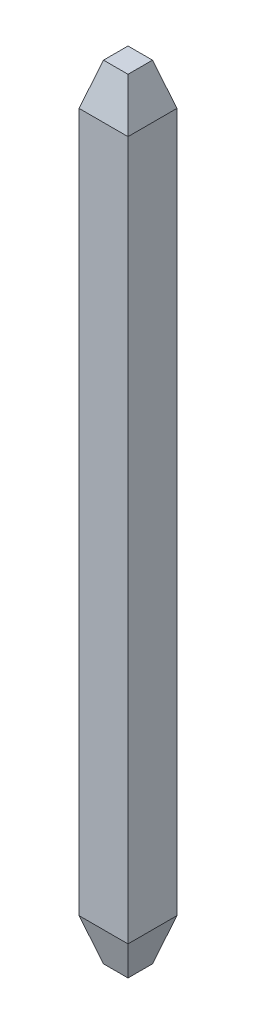
ISO-10303-21;
HEADER;
FILE_DESCRIPTION(('STEP AP214'),'2;1');
FILE_NAME('part.step','',(''),(''),'','','');
FILE_SCHEMA(('AUTOMOTIVE_DESIGN { 1 0 10303 214 1 1 1 1 }'));
ENDSEC;
DATA;
#1=APPLICATION_CONTEXT('core data for automotive mechanical design processes');
#2=APPLICATION_PROTOCOL_DEFINITION('international standard','automotive_design',2000,#1);
#3=PRODUCT_CONTEXT('',#1,'mechanical');
#4=PRODUCT('Part','Part','',(#3));
#5=PRODUCT_RELATED_PRODUCT_CATEGORY('part','',(#4));
#6=PRODUCT_DEFINITION_FORMATION('','',#4);
#7=PRODUCT_DEFINITION_CONTEXT('part definition',#1,'design');
#8=PRODUCT_DEFINITION('design','',#6,#7);
#9=PRODUCT_DEFINITION_SHAPE('','',#8);
#10=(LENGTH_UNIT() NAMED_UNIT(*) SI_UNIT(.MILLI.,.METRE.));
#11=(NAMED_UNIT(*) PLANE_ANGLE_UNIT() SI_UNIT($,.RADIAN.));
#12=(NAMED_UNIT(*) SI_UNIT($,.STERADIAN.) SOLID_ANGLE_UNIT());
#13=UNCERTAINTY_MEASURE_WITH_UNIT(LENGTH_MEASURE(1.E-05),#10,'distance_accuracy_value','');
#14=(GEOMETRIC_REPRESENTATION_CONTEXT(3) GLOBAL_UNCERTAINTY_ASSIGNED_CONTEXT((#13)) GLOBAL_UNIT_ASSIGNED_CONTEXT((#10,
#11,#12)) REPRESENTATION_CONTEXT('',''));
#15=CARTESIAN_POINT('',(0.,0.,0.));
#16=DIRECTION('',(0.,0.,1.));
#17=DIRECTION('',(1.,0.,0.));
#18=AXIS2_PLACEMENT_3D('',#15,#16,#17);
#19=CARTESIAN_POINT('',(-1.43099999998702,-5.53543505344793,-19.1999999999763));
#20=DIRECTION('',(0.,0.,1.));
#21=DIRECTION('',(1.,0.,0.));
#22=AXIS2_PLACEMENT_3D('',#19,#20,#21);
#23=PLANE('',#22);
#24=DIRECTION('',(0.,1.,0.));
#25=VECTOR('',#24,1.);
#26=CARTESIAN_POINT('',(-1.42999999998704,-10.1039999999832,-19.1999999999763));
#27=LINE('',#26,#25);
#28=CARTESIAN_POINT('',(-1.42999999998704,-10.1039999999832,-19.1999999999763));
#29=VERTEX_POINT('',#28);
#30=CARTESIAN_POINT('',(-1.42999999998704,-0.965870106912663,-19.1999999999763));
#31=VERTEX_POINT('',#30);
#32=EDGE_CURVE('E186',#29,#31,#27,.T.);
#33=ORIENTED_EDGE('',*,*,#32,.F.);
#34=DIRECTION('',(-1.,0.,0.));
#35=VECTOR('',#34,1.);
#36=CARTESIAN_POINT('',(-0.789999999987025,-10.1039999999832,-19.1999999999763));
#37=LINE('',#36,#35);
#38=CARTESIAN_POINT('',(-0.789999999987053,-10.1039999999832,-19.1999999999763));
#39=VERTEX_POINT('',#38);
#40=EDGE_CURVE('E42',#39,#29,#37,.T.);
#41=ORIENTED_EDGE('',*,*,#40,.F.);
#42=DIRECTION('',(0.,1.,0.));
#43=VECTOR('',#42,1.);
#44=CARTESIAN_POINT('',(-0.789999999987025,-10.1039999999832,-19.1999999999763));
#45=LINE('',#44,#43);
#46=CARTESIAN_POINT('',(-0.789999999987053,-0.965870106912663,-19.1999999999763));
#47=VERTEX_POINT('',#46);
#48=EDGE_CURVE('E11',#39,#47,#45,.T.);
#49=ORIENTED_EDGE('',*,*,#48,.T.);
#50=DIRECTION('',(-1.,0.,0.));
#51=VECTOR('',#50,1.);
#52=CARTESIAN_POINT('',(-0.789999999987025,-0.965870106912661,-19.1999999999763));
#53=LINE('',#52,#51);
#54=EDGE_CURVE('E28',#47,#31,#53,.T.);
#55=ORIENTED_EDGE('',*,*,#54,.T.);
#56=EDGE_LOOP('',(#33,#41,#49,#55));
#57=FACE_BOUND('',#56,.T.);
#58=ADVANCED_FACE('F17',(#57),#23,.T.);
#59=CARTESIAN_POINT('',(-1.42999999998704,-5.53543505344793,-19.1989999999763));
#60=DIRECTION('',(-1.,0.,0.));
#61=DIRECTION('',(0.,0.,1.));
#62=AXIS2_PLACEMENT_3D('',#59,#60,#61);
#63=PLANE('',#62);
#64=DIRECTION('',(0.,1.,0.));
#65=VECTOR('',#64,1.);
#66=CARTESIAN_POINT('',(-1.42999999998704,-10.1039999999832,-19.8399999999763));
#67=LINE('',#66,#65);
#68=CARTESIAN_POINT('',(-1.42999999998704,-10.1039999999832,-19.8399999999763));
#69=VERTEX_POINT('',#68);
#70=CARTESIAN_POINT('',(-1.42999999998704,-0.965870106912663,-19.8399999999763));
#71=VERTEX_POINT('',#70);
#72=EDGE_CURVE('E140',#69,#71,#67,.T.);
#73=ORIENTED_EDGE('',*,*,#72,.F.);
#74=DIRECTION('',(0.,0.,-1.));
#75=VECTOR('',#74,1.);
#76=CARTESIAN_POINT('',(-1.42999999998704,-10.1039999999832,-19.1999999999763));
#77=LINE('',#76,#75);
#78=EDGE_CURVE('E175',#29,#69,#77,.T.);
#79=ORIENTED_EDGE('',*,*,#78,.F.);
#80=ORIENTED_EDGE('',*,*,#32,.T.);
#81=DIRECTION('',(0.,0.,-1.));
#82=VECTOR('',#81,1.);
#83=CARTESIAN_POINT('',(-1.42999999998704,-0.965870106912661,-19.1999999999763));
#84=LINE('',#83,#82);
#85=EDGE_CURVE('E189',#31,#71,#84,.T.);
#86=ORIENTED_EDGE('',*,*,#85,.T.);
#87=EDGE_LOOP('',(#73,#79,#80,#86));
#88=FACE_BOUND('',#87,.T.);
#89=ADVANCED_FACE('F368',(#88),#63,.T.);
#90=CARTESIAN_POINT('',(-0.78899999998702,-5.53443505344793,-19.8399999999763));
#91=DIRECTION('',(0.,0.,-1.));
#92=DIRECTION('',(0.,-1.,0.));
#93=AXIS2_PLACEMENT_3D('',#90,#91,#92);
#94=PLANE('',#93);
#95=DIRECTION('',(0.,1.,0.));
#96=VECTOR('',#95,1.);
#97=CARTESIAN_POINT('',(-0.789999999987025,-10.1039999999832,-19.8399999999763));
#98=LINE('',#97,#96);
#99=CARTESIAN_POINT('',(-0.789999999987053,-10.1039999999832,-19.8399999999763));
#100=VERTEX_POINT('',#99);
#101=CARTESIAN_POINT('',(-0.789999999987053,-0.965870106912663,-19.8399999999763));
#102=VERTEX_POINT('',#101);
#103=EDGE_CURVE('E111',#100,#102,#98,.T.);
#104=ORIENTED_EDGE('',*,*,#103,.F.);
#105=DIRECTION('',(1.,0.,0.));
#106=VECTOR('',#105,1.);
#107=CARTESIAN_POINT('',(-1.42999999998704,-10.1039999999832,-19.8399999999763));
#108=LINE('',#107,#106);
#109=EDGE_CURVE('E154',#69,#100,#108,.T.);
#110=ORIENTED_EDGE('',*,*,#109,.F.);
#111=ORIENTED_EDGE('',*,*,#72,.T.);
#112=DIRECTION('',(1.,0.,0.));
#113=VECTOR('',#112,1.);
#114=CARTESIAN_POINT('',(-1.42999999998704,-0.965870106912661,-19.8399999999763));
#115=LINE('',#114,#113);
#116=EDGE_CURVE('E130',#71,#102,#115,.T.);
#117=ORIENTED_EDGE('',*,*,#116,.T.);
#118=EDGE_LOOP('',(#104,#110,#111,#117));
#119=FACE_BOUND('',#118,.T.);
#120=ADVANCED_FACE('F138',(#119),#94,.T.);
#121=CARTESIAN_POINT('',(-1.10999999998703,-0.965870106912661,-19.8399999999763));
#122=DIRECTION('',(0.,0.281214622974643,-0.959644900900968));
#123=DIRECTION('',(-1.,0.,0.));
#124=AXIS2_PLACEMENT_3D('',#121,#122,#123);
#125=PLANE('',#124);
#126=DIRECTION('',(0.270714017147727,0.923811583516618,0.270714017147727));
#127=VECTOR('',#126,1.);
#128=CARTESIAN_POINT('',(-1.42999999998704,-0.965870106912661,-19.8399999999763));
#129=LINE('',#128,#127);
#130=CARTESIAN_POINT('',(-1.26999999998704,-0.419870106912663,-19.6799999999763));
#131=VERTEX_POINT('',#130);
#132=EDGE_CURVE('E143',#71,#131,#129,.T.);
#133=ORIENTED_EDGE('',*,*,#132,.T.);
#134=DIRECTION('',(1.,0.,0.));
#135=VECTOR('',#134,1.);
#136=CARTESIAN_POINT('',(-1.26999999998704,-0.419870106912661,-19.6799999999763));
#137=LINE('',#136,#135);
#138=CARTESIAN_POINT('',(-0.94999999998705,-0.419870106912663,-19.6799999999763));
#139=VERTEX_POINT('',#138);
#140=EDGE_CURVE('E132',#131,#139,#137,.T.);
#141=ORIENTED_EDGE('',*,*,#140,.T.);
#142=DIRECTION('',(-0.270714017147721,0.923811583516619,0.270714017147728));
#143=VECTOR('',#142,1.);
#144=CARTESIAN_POINT('',(-0.789999999987025,-0.965870106912661,-19.8399999999763));
#145=LINE('',#144,#143);
#146=EDGE_CURVE('E127',#102,#139,#145,.T.);
#147=ORIENTED_EDGE('',*,*,#146,.F.);
#148=ORIENTED_EDGE('',*,*,#116,.F.);
#149=EDGE_LOOP('',(#133,#141,#147,#148));
#150=FACE_BOUND('',#149,.T.);
#151=ADVANCED_FACE('F129',(#150),#125,.T.);
#152=CARTESIAN_POINT('',(-0.789999999987025,-0.965870106912661,-19.5199999999763));
#153=DIRECTION('',(0.95964490090097,0.281214622974637,0.));
#154=DIRECTION('',(0.,0.,-1.));
#155=AXIS2_PLACEMENT_3D('',#152,#153,#154);
#156=PLANE('',#155);
#157=ORIENTED_EDGE('',*,*,#146,.T.);
#158=DIRECTION('',(0.,0.,1.));
#159=VECTOR('',#158,1.);
#160=CARTESIAN_POINT('',(-0.949999999987021,-0.419870106912661,-19.6799999999763));
#161=LINE('',#160,#159);
#162=CARTESIAN_POINT('',(-0.94999999998705,-0.419870106912663,-19.3599999999763));
#163=VERTEX_POINT('',#162);
#164=EDGE_CURVE('E136',#139,#163,#161,.T.);
#165=ORIENTED_EDGE('',*,*,#164,.T.);
#166=DIRECTION('',(-0.270714017147721,0.923811583516619,-0.270714017147728));
#167=VECTOR('',#166,1.);
#168=CARTESIAN_POINT('',(-0.789999999987025,-0.965870106912661,-19.1999999999763));
#169=LINE('',#168,#167);
#170=EDGE_CURVE('E102',#47,#163,#169,.T.);
#171=ORIENTED_EDGE('',*,*,#170,.F.);
#172=DIRECTION('',(0.,0.,1.));
#173=VECTOR('',#172,1.);
#174=CARTESIAN_POINT('',(-0.789999999987025,-0.965870106912661,-19.8399999999763));
#175=LINE('',#174,#173);
#176=EDGE_CURVE('E116',#102,#47,#175,.T.);
#177=ORIENTED_EDGE('',*,*,#176,.F.);
#178=EDGE_LOOP('',(#157,#165,#171,#177));
#179=FACE_BOUND('',#178,.T.);
#180=ADVANCED_FACE('F145',(#179),#156,.T.);
#181=CARTESIAN_POINT('',(-1.10999999998703,-0.419870106912661,-19.6809999999763));
#182=DIRECTION('',(0.,1.,0.));
#183=DIRECTION('',(1.,0.,0.));
#184=AXIS2_PLACEMENT_3D('',#181,#182,#183);
#185=PLANE('',#184);
#186=ORIENTED_EDGE('',*,*,#140,.F.);
#187=DIRECTION('',(0.,0.,-1.));
#188=VECTOR('',#187,1.);
#189=CARTESIAN_POINT('',(-1.26999999998704,-0.419870106912661,-19.3599999999763));
#190=LINE('',#189,#188);
#191=CARTESIAN_POINT('',(-1.26999999998704,-0.419870106912663,-19.3599999999763));
#192=VERTEX_POINT('',#191);
#193=EDGE_CURVE('E171',#192,#131,#190,.T.);
#194=ORIENTED_EDGE('',*,*,#193,.F.);
#195=DIRECTION('',(-1.,0.,0.));
#196=VECTOR('',#195,1.);
#197=CARTESIAN_POINT('',(-0.949999999987021,-0.419870106912661,-19.3599999999763));
#198=LINE('',#197,#196);
#199=EDGE_CURVE('E95',#163,#192,#198,.T.);
#200=ORIENTED_EDGE('',*,*,#199,.F.);
#201=ORIENTED_EDGE('',*,*,#164,.F.);
#202=EDGE_LOOP('',(#186,#194,#200,#201));
#203=FACE_BOUND('',#202,.T.);
#204=ADVANCED_FACE('F393',(#203),#185,.T.);
#205=CARTESIAN_POINT('',(-1.10999999998703,-10.1039999999832,-19.8399999999763));
#206=DIRECTION('',(0.,-0.281214622974643,-0.959644900900968));
#207=DIRECTION('',(0.,-0.959644900900968,0.281214622974643));
#208=AXIS2_PLACEMENT_3D('',#205,#206,#207);
#209=PLANE('',#208);
#210=ORIENTED_EDGE('',*,*,#109,.T.);
#211=DIRECTION('',(-0.270714017147721,-0.923811583516619,0.270714017147728));
#212=VECTOR('',#211,1.);
#213=CARTESIAN_POINT('',(-0.789999999987025,-10.1039999999832,-19.8399999999763));
#214=LINE('',#213,#212);
#215=CARTESIAN_POINT('',(-0.94999999998705,-10.6499999999832,-19.6799999999763));
#216=VERTEX_POINT('',#215);
#217=EDGE_CURVE('E163',#100,#216,#214,.T.);
#218=ORIENTED_EDGE('',*,*,#217,.T.);
#219=DIRECTION('',(1.,0.,0.));
#220=VECTOR('',#219,1.);
#221=CARTESIAN_POINT('',(-1.26999999998704,-10.6499999999832,-19.6799999999763));
#222=LINE('',#221,#220);
#223=CARTESIAN_POINT('',(-1.26999999998704,-10.6499999999832,-19.6799999999763));
#224=VERTEX_POINT('',#223);
#225=EDGE_CURVE('E170',#224,#216,#222,.T.);
#226=ORIENTED_EDGE('',*,*,#225,.F.);
#227=DIRECTION('',(0.270714017147727,-0.923811583516618,0.270714017147727));
#228=VECTOR('',#227,1.);
#229=CARTESIAN_POINT('',(-1.42999999998704,-10.1039999999832,-19.8399999999763));
#230=LINE('',#229,#228);
#231=EDGE_CURVE('E211',#69,#224,#230,.T.);
#232=ORIENTED_EDGE('',*,*,#231,.F.);
#233=EDGE_LOOP('',(#210,#218,#226,#232));
#234=FACE_BOUND('',#233,.T.);
#235=ADVANCED_FACE('F210',(#234),#209,.T.);
#236=CARTESIAN_POINT('',(-1.27099999998702,-10.6499999999832,-19.5199999999763));
#237=DIRECTION('',(0.,-1.,0.));
#238=DIRECTION('',(0.,0.,-1.));
#239=AXIS2_PLACEMENT_3D('',#236,#237,#238);
#240=PLANE('',#239);
#241=DIRECTION('',(0.,0.,1.));
#242=VECTOR('',#241,1.);
#243=CARTESIAN_POINT('',(-0.949999999987021,-10.6499999999832,-19.6799999999763));
#244=LINE('',#243,#242);
#245=CARTESIAN_POINT('',(-0.94999999998705,-10.6499999999832,-19.3599999999763));
#246=VERTEX_POINT('',#245);
#247=EDGE_CURVE('E167',#216,#246,#244,.T.);
#248=ORIENTED_EDGE('',*,*,#247,.T.);
#249=DIRECTION('',(-1.,0.,0.));
#250=VECTOR('',#249,1.);
#251=CARTESIAN_POINT('',(-0.949999999987021,-10.6499999999832,-19.3599999999763));
#252=LINE('',#251,#250);
#253=CARTESIAN_POINT('',(-1.26999999998704,-10.6499999999832,-19.3599999999763));
#254=VERTEX_POINT('',#253);
#255=EDGE_CURVE('E181',#246,#254,#252,.T.);
#256=ORIENTED_EDGE('',*,*,#255,.T.);
#257=DIRECTION('',(0.,0.,-1.));
#258=VECTOR('',#257,1.);
#259=CARTESIAN_POINT('',(-1.26999999998704,-10.6499999999832,-19.3599999999763));
#260=LINE('',#259,#258);
#261=EDGE_CURVE('E185',#254,#224,#260,.T.);
#262=ORIENTED_EDGE('',*,*,#261,.T.);
#263=ORIENTED_EDGE('',*,*,#225,.T.);
#264=EDGE_LOOP('',(#248,#256,#262,#263));
#265=FACE_BOUND('',#264,.T.);
#266=ADVANCED_FACE('F242',(#265),#240,.T.);
#267=CARTESIAN_POINT('',(-0.789999999987025,-10.1039999999832,-19.5199999999763));
#268=DIRECTION('',(0.95964490090097,-0.281214622974637,0.));
#269=DIRECTION('',(0.,0.,-1.));
#270=AXIS2_PLACEMENT_3D('',#267,#268,#269);
#271=PLANE('',#270);
#272=DIRECTION('',(0.,0.,1.));
#273=VECTOR('',#272,1.);
#274=CARTESIAN_POINT('',(-0.789999999987025,-10.1039999999832,-19.8399999999763));
#275=LINE('',#274,#273);
#276=EDGE_CURVE('E118',#100,#39,#275,.T.);
#277=ORIENTED_EDGE('',*,*,#276,.T.);
#278=DIRECTION('',(-0.270714017147721,-0.923811583516619,-0.270714017147728));
#279=VECTOR('',#278,1.);
#280=CARTESIAN_POINT('',(-0.789999999987025,-10.1039999999832,-19.1999999999763));
#281=LINE('',#280,#279);
#282=EDGE_CURVE('E156',#39,#246,#281,.T.);
#283=ORIENTED_EDGE('',*,*,#282,.T.);
#284=ORIENTED_EDGE('',*,*,#247,.F.);
#285=ORIENTED_EDGE('',*,*,#217,.F.);
#286=EDGE_LOOP('',(#277,#283,#284,#285));
#287=FACE_BOUND('',#286,.T.);
#288=ADVANCED_FACE('F19',(#287),#271,.T.);
#289=CARTESIAN_POINT('',(-1.42999999998704,-0.965870106912661,-19.5199999999763));
#290=DIRECTION('',(-0.959644900900968,0.281214622974643,0.));
#291=DIRECTION('',(0.,0.,1.));
#292=AXIS2_PLACEMENT_3D('',#289,#290,#291);
#293=PLANE('',#292);
#294=DIRECTION('',(0.270714017147727,0.923811583516618,-0.270714017147727));
#295=VECTOR('',#294,1.);
#296=CARTESIAN_POINT('',(-1.42999999998704,-0.965870106912661,-19.1999999999763));
#297=LINE('',#296,#295);
#298=EDGE_CURVE('E159',#31,#192,#297,.T.);
#299=ORIENTED_EDGE('',*,*,#298,.T.);
#300=ORIENTED_EDGE('',*,*,#193,.T.);
#301=ORIENTED_EDGE('',*,*,#132,.F.);
#302=ORIENTED_EDGE('',*,*,#85,.F.);
#303=EDGE_LOOP('',(#299,#300,#301,#302));
#304=FACE_BOUND('',#303,.T.);
#305=ADVANCED_FACE('F195',(#304),#293,.T.);
#306=CARTESIAN_POINT('',(-1.42999999998704,-10.1039999999832,-19.5199999999763));
#307=DIRECTION('',(-0.959644900900968,-0.281214622974643,0.));
#308=DIRECTION('',(-0.281214622974643,0.959644900900968,0.));
#309=AXIS2_PLACEMENT_3D('',#306,#307,#308);
#310=PLANE('',#309);
#311=ORIENTED_EDGE('',*,*,#78,.T.);
#312=ORIENTED_EDGE('',*,*,#231,.T.);
#313=ORIENTED_EDGE('',*,*,#261,.F.);
#314=DIRECTION('',(0.270714017147727,-0.923811583516618,-0.270714017147727));
#315=VECTOR('',#314,1.);
#316=CARTESIAN_POINT('',(-1.42999999998704,-10.1039999999832,-19.1999999999763));
#317=LINE('',#316,#315);
#318=EDGE_CURVE('E21',#29,#254,#317,.T.);
#319=ORIENTED_EDGE('',*,*,#318,.F.);
#320=EDGE_LOOP('',(#311,#312,#313,#319));
#321=FACE_BOUND('',#320,.T.);
#322=ADVANCED_FACE('F244',(#321),#310,.T.);
#323=CARTESIAN_POINT('',(-1.10999999998703,-0.965870106912661,-19.1999999999763));
#324=DIRECTION('',(0.,0.281214622974643,0.959644900900968));
#325=DIRECTION('',(1.,0.,0.));
#326=AXIS2_PLACEMENT_3D('',#323,#324,#325);
#327=PLANE('',#326);
#328=ORIENTED_EDGE('',*,*,#170,.T.);
#329=ORIENTED_EDGE('',*,*,#199,.T.);
#330=ORIENTED_EDGE('',*,*,#298,.F.);
#331=ORIENTED_EDGE('',*,*,#54,.F.);
#332=EDGE_LOOP('',(#328,#329,#330,#331));
#333=FACE_BOUND('',#332,.T.);
#334=ADVANCED_FACE('F197',(#333),#327,.T.);
#335=CARTESIAN_POINT('',(-0.789999999987025,-11.0738701069127,-19.5199999999763));
#336=DIRECTION('',(1.,0.,0.));
#337=DIRECTION('',(0.,1.,0.));
#338=AXIS2_PLACEMENT_3D('',#335,#336,#337);
#339=PLANE('',#338);
#340=ORIENTED_EDGE('',*,*,#48,.F.);
#341=ORIENTED_EDGE('',*,*,#276,.F.);
#342=ORIENTED_EDGE('',*,*,#103,.T.);
#343=ORIENTED_EDGE('',*,*,#176,.T.);
#344=EDGE_LOOP('',(#340,#341,#342,#343));
#345=FACE_BOUND('',#344,.T.);
#346=ADVANCED_FACE('F114',(#345),#339,.T.);
#347=CARTESIAN_POINT('',(-1.10999999998703,-10.1039999999832,-19.1999999999763));
#348=DIRECTION('',(0.,-0.281214622974643,0.959644900900968));
#349=DIRECTION('',(-1.,0.,0.));
#350=AXIS2_PLACEMENT_3D('',#347,#348,#349);
#351=PLANE('',#350);
#352=ORIENTED_EDGE('',*,*,#40,.T.);
#353=ORIENTED_EDGE('',*,*,#318,.T.);
#354=ORIENTED_EDGE('',*,*,#255,.F.);
#355=ORIENTED_EDGE('',*,*,#282,.F.);
#356=EDGE_LOOP('',(#352,#353,#354,#355));
#357=FACE_BOUND('',#356,.T.);
#358=ADVANCED_FACE('F203',(#357),#351,.T.);
#359=CLOSED_SHELL('',(#58,#89,#120,#151,#180,#204,#235,#266,#288,#305,#322,#334,#346,#358));
#360=MANIFOLD_SOLID_BREP('B1',#359);
#361=ADVANCED_BREP_SHAPE_REPRESENTATION('',(#18,#360),#14);
#362=SHAPE_DEFINITION_REPRESENTATION(#9,#361);
ENDSEC;
END-ISO-10303-21;
